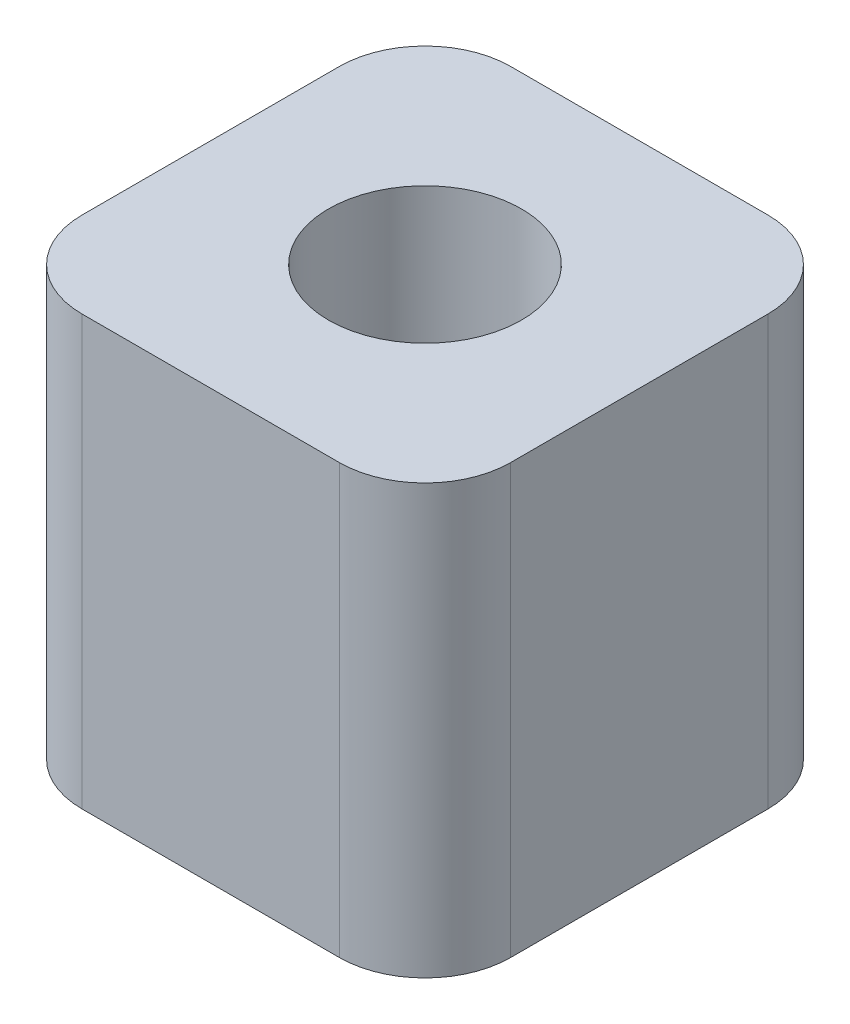
ISO-10303-21;
HEADER;
FILE_DESCRIPTION(('STEP AP214'),'2;1');
FILE_NAME('part.step','',(''),(''),'','','');
FILE_SCHEMA(('AUTOMOTIVE_DESIGN { 1 0 10303 214 1 1 1 1 }'));
ENDSEC;
DATA;
#1=APPLICATION_CONTEXT('core data for automotive mechanical design processes');
#2=APPLICATION_PROTOCOL_DEFINITION('international standard','automotive_design',2000,#1);
#3=PRODUCT_CONTEXT('',#1,'mechanical');
#4=PRODUCT('Part','Part','',(#3));
#5=PRODUCT_RELATED_PRODUCT_CATEGORY('part','',(#4));
#6=PRODUCT_DEFINITION_FORMATION('','',#4);
#7=PRODUCT_DEFINITION_CONTEXT('part definition',#1,'design');
#8=PRODUCT_DEFINITION('design','',#6,#7);
#9=PRODUCT_DEFINITION_SHAPE('','',#8);
#10=(LENGTH_UNIT() NAMED_UNIT(*) SI_UNIT(.MILLI.,.METRE.));
#11=(NAMED_UNIT(*) PLANE_ANGLE_UNIT() SI_UNIT($,.RADIAN.));
#12=(NAMED_UNIT(*) SI_UNIT($,.STERADIAN.) SOLID_ANGLE_UNIT());
#13=UNCERTAINTY_MEASURE_WITH_UNIT(LENGTH_MEASURE(1.E-05),#10,'distance_accuracy_value','');
#14=(GEOMETRIC_REPRESENTATION_CONTEXT(3) GLOBAL_UNCERTAINTY_ASSIGNED_CONTEXT((#13)) GLOBAL_UNIT_ASSIGNED_CONTEXT((#10,
#11,#12)) REPRESENTATION_CONTEXT('',''));
#15=CARTESIAN_POINT('',(0.,0.,0.));
#16=DIRECTION('',(0.,0.,1.));
#17=DIRECTION('',(1.,0.,0.));
#18=AXIS2_PLACEMENT_3D('',#15,#16,#17);
#19=CARTESIAN_POINT('',(0.,10.,0.));
#20=DIRECTION('',(0.,-1.,0.));
#21=DIRECTION('',(0.,0.,-1.));
#22=AXIS2_PLACEMENT_3D('',#19,#20,#21);
#23=PLANE('',#22);
#24=DIRECTION('',(0.,0.,1.));
#25=VECTOR('',#24,1.);
#26=CARTESIAN_POINT('',(-5.,10.,5.));
#27=LINE('',#26,#25);
#28=CARTESIAN_POINT('',(-5.,10.,-3.));
#29=VERTEX_POINT('',#28);
#30=CARTESIAN_POINT('',(-5.,10.,3.));
#31=VERTEX_POINT('',#30);
#32=EDGE_CURVE('E199',#29,#31,#27,.T.);
#33=ORIENTED_EDGE('',*,*,#32,.T.);
#34=CARTESIAN_POINT('',(-3.,10.,3.));
#35=DIRECTION('',(0.,-1.,0.));
#36=DIRECTION('',(0.,0.,-1.));
#37=AXIS2_PLACEMENT_3D('',#34,#35,#36);
#38=CIRCLE('',#37,2.);
#39=CARTESIAN_POINT('',(-3.,10.,5.));
#40=VERTEX_POINT('',#39);
#41=EDGE_CURVE('E168',#31,#40,#38,.F.);
#42=ORIENTED_EDGE('',*,*,#41,.T.);
#43=DIRECTION('',(1.,0.,0.));
#44=VECTOR('',#43,1.);
#45=CARTESIAN_POINT('',(-5.,10.,5.));
#46=LINE('',#45,#44);
#47=CARTESIAN_POINT('',(3.,10.,5.));
#48=VERTEX_POINT('',#47);
#49=EDGE_CURVE('E126',#40,#48,#46,.T.);
#50=ORIENTED_EDGE('',*,*,#49,.T.);
#51=CARTESIAN_POINT('',(3.,10.,3.));
#52=DIRECTION('',(0.,-1.,0.));
#53=DIRECTION('',(0.,0.,-1.));
#54=AXIS2_PLACEMENT_3D('',#51,#52,#53);
#55=CIRCLE('',#54,2.);
#56=CARTESIAN_POINT('',(5.,10.,3.));
#57=VERTEX_POINT('',#56);
#58=EDGE_CURVE('E160',#48,#57,#55,.F.);
#59=ORIENTED_EDGE('',*,*,#58,.T.);
#60=DIRECTION('',(0.,0.,-1.));
#61=VECTOR('',#60,1.);
#62=CARTESIAN_POINT('',(5.,10.,5.));
#63=LINE('',#62,#61);
#64=CARTESIAN_POINT('',(5.,10.,-3.));
#65=VERTEX_POINT('',#64);
#66=EDGE_CURVE('E135',#57,#65,#63,.T.);
#67=ORIENTED_EDGE('',*,*,#66,.T.);
#68=CARTESIAN_POINT('',(3.,10.,-3.));
#69=DIRECTION('',(0.,-1.,0.));
#70=DIRECTION('',(0.,0.,-1.));
#71=AXIS2_PLACEMENT_3D('',#68,#69,#70);
#72=CIRCLE('',#71,2.);
#73=CARTESIAN_POINT('',(3.,10.,-5.));
#74=VERTEX_POINT('',#73);
#75=EDGE_CURVE('E61',#65,#74,#72,.F.);
#76=ORIENTED_EDGE('',*,*,#75,.T.);
#77=DIRECTION('',(-1.,0.,0.));
#78=VECTOR('',#77,1.);
#79=CARTESIAN_POINT('',(-5.,10.,-5.));
#80=LINE('',#79,#78);
#81=CARTESIAN_POINT('',(-3.,10.,-5.));
#82=VERTEX_POINT('',#81);
#83=EDGE_CURVE('E140',#74,#82,#80,.T.);
#84=ORIENTED_EDGE('',*,*,#83,.T.);
#85=CARTESIAN_POINT('',(-3.,10.,-3.));
#86=DIRECTION('',(0.,-1.,0.));
#87=DIRECTION('',(0.,0.,-1.));
#88=AXIS2_PLACEMENT_3D('',#85,#86,#87);
#89=CIRCLE('',#88,2.);
#90=EDGE_CURVE('E165',#82,#29,#89,.F.);
#91=ORIENTED_EDGE('',*,*,#90,.T.);
#92=EDGE_LOOP('',(#33,#42,#50,#59,#67,#76,#84,#91));
#93=FACE_BOUND('',#92,.T.);
#94=CARTESIAN_POINT('',(0.,10.,0.));
#95=DIRECTION('',(0.,1.,0.));
#96=DIRECTION('',(0.,0.,1.));
#97=AXIS2_PLACEMENT_3D('',#94,#95,#96);
#98=CIRCLE('',#97,2.25);
#99=CARTESIAN_POINT('',(0.,10.,2.25));
#100=VERTEX_POINT('',#99);
#101=EDGE_CURVE('E189',#100,#100,#98,.T.);
#102=ORIENTED_EDGE('',*,*,#101,.F.);
#103=EDGE_LOOP('',(#102));
#104=FACE_BOUND('',#103,.T.);
#105=ADVANCED_FACE('F38',(#93,#104),#23,.F.);
#106=CARTESIAN_POINT('',(0.,0.,0.));
#107=DIRECTION('',(0.,-1.,0.));
#108=DIRECTION('',(0.,0.,-1.));
#109=AXIS2_PLACEMENT_3D('',#106,#107,#108);
#110=PLANE('',#109);
#111=DIRECTION('',(1.,0.,0.));
#112=VECTOR('',#111,1.);
#113=CARTESIAN_POINT('',(-5.,0.,5.));
#114=LINE('',#113,#112);
#115=CARTESIAN_POINT('',(-3.,0.,5.));
#116=VERTEX_POINT('',#115);
#117=CARTESIAN_POINT('',(3.,0.,5.));
#118=VERTEX_POINT('',#117);
#119=EDGE_CURVE('E123',#116,#118,#114,.T.);
#120=ORIENTED_EDGE('',*,*,#119,.F.);
#121=CARTESIAN_POINT('',(-3.,0.,3.));
#122=DIRECTION('',(0.,-1.,0.));
#123=DIRECTION('',(0.,0.,-1.));
#124=AXIS2_PLACEMENT_3D('',#121,#122,#123);
#125=CIRCLE('',#124,2.);
#126=CARTESIAN_POINT('',(-5.,0.,3.));
#127=VERTEX_POINT('',#126);
#128=EDGE_CURVE('E105',#116,#127,#125,.T.);
#129=ORIENTED_EDGE('',*,*,#128,.T.);
#130=DIRECTION('',(0.,0.,1.));
#131=VECTOR('',#130,1.);
#132=CARTESIAN_POINT('',(-5.,0.,5.));
#133=LINE('',#132,#131);
#134=CARTESIAN_POINT('',(-5.,0.,-3.));
#135=VERTEX_POINT('',#134);
#136=EDGE_CURVE('E136',#135,#127,#133,.T.);
#137=ORIENTED_EDGE('',*,*,#136,.F.);
#138=CARTESIAN_POINT('',(-3.,0.,-3.));
#139=DIRECTION('',(0.,-1.,0.));
#140=DIRECTION('',(0.,0.,-1.));
#141=AXIS2_PLACEMENT_3D('',#138,#139,#140);
#142=CIRCLE('',#141,2.);
#143=CARTESIAN_POINT('',(-3.,0.,-5.));
#144=VERTEX_POINT('',#143);
#145=EDGE_CURVE('E117',#135,#144,#142,.T.);
#146=ORIENTED_EDGE('',*,*,#145,.T.);
#147=DIRECTION('',(-1.,0.,0.));
#148=VECTOR('',#147,1.);
#149=CARTESIAN_POINT('',(-5.,0.,-5.));
#150=LINE('',#149,#148);
#151=CARTESIAN_POINT('',(3.,0.,-5.));
#152=VERTEX_POINT('',#151);
#153=EDGE_CURVE('E142',#152,#144,#150,.T.);
#154=ORIENTED_EDGE('',*,*,#153,.F.);
#155=CARTESIAN_POINT('',(3.,0.,-3.));
#156=DIRECTION('',(0.,-1.,0.));
#157=DIRECTION('',(0.,0.,-1.));
#158=AXIS2_PLACEMENT_3D('',#155,#156,#157);
#159=CIRCLE('',#158,2.);
#160=CARTESIAN_POINT('',(5.,0.,-3.));
#161=VERTEX_POINT('',#160);
#162=EDGE_CURVE('E150',#152,#161,#159,.T.);
#163=ORIENTED_EDGE('',*,*,#162,.T.);
#164=DIRECTION('',(0.,0.,-1.));
#165=VECTOR('',#164,1.);
#166=CARTESIAN_POINT('',(5.,0.,5.));
#167=LINE('',#166,#165);
#168=CARTESIAN_POINT('',(5.,0.,3.));
#169=VERTEX_POINT('',#168);
#170=EDGE_CURVE('E183',#169,#161,#167,.T.);
#171=ORIENTED_EDGE('',*,*,#170,.F.);
#172=CARTESIAN_POINT('',(3.,0.,3.));
#173=DIRECTION('',(0.,-1.,0.));
#174=DIRECTION('',(0.,0.,-1.));
#175=AXIS2_PLACEMENT_3D('',#172,#173,#174);
#176=CIRCLE('',#175,2.);
#177=EDGE_CURVE('E128',#169,#118,#176,.T.);
#178=ORIENTED_EDGE('',*,*,#177,.T.);
#179=EDGE_LOOP('',(#120,#129,#137,#146,#154,#163,#171,#178));
#180=FACE_BOUND('',#179,.T.);
#181=CARTESIAN_POINT('',(0.,0.,0.));
#182=DIRECTION('',(0.,1.,0.));
#183=DIRECTION('',(0.,0.,1.));
#184=AXIS2_PLACEMENT_3D('',#181,#182,#183);
#185=CIRCLE('',#184,2.25);
#186=CARTESIAN_POINT('',(0.,0.,2.25));
#187=VERTEX_POINT('',#186);
#188=EDGE_CURVE('E194',#187,#187,#185,.T.);
#189=ORIENTED_EDGE('',*,*,#188,.T.);
#190=EDGE_LOOP('',(#189));
#191=FACE_BOUND('',#190,.T.);
#192=ADVANCED_FACE('F131',(#180,#191),#110,.T.);
#193=CARTESIAN_POINT('',(5.,10.,5.));
#194=DIRECTION('',(-1.,0.,0.));
#195=DIRECTION('',(0.,0.,1.));
#196=AXIS2_PLACEMENT_3D('',#193,#194,#195);
#197=PLANE('',#196);
#198=ORIENTED_EDGE('',*,*,#170,.T.);
#199=DIRECTION('',(0.,-1.,0.));
#200=VECTOR('',#199,1.);
#201=CARTESIAN_POINT('',(5.,10.,-3.));
#202=LINE('',#201,#200);
#203=EDGE_CURVE('E11',#161,#65,#202,.F.);
#204=ORIENTED_EDGE('',*,*,#203,.T.);
#205=ORIENTED_EDGE('',*,*,#66,.F.);
#206=DIRECTION('',(0.,-1.,0.));
#207=VECTOR('',#206,1.);
#208=CARTESIAN_POINT('',(5.,10.,3.));
#209=LINE('',#208,#207);
#210=EDGE_CURVE('E47',#57,#169,#209,.T.);
#211=ORIENTED_EDGE('',*,*,#210,.T.);
#212=EDGE_LOOP('',(#198,#204,#205,#211));
#213=FACE_BOUND('',#212,.T.);
#214=ADVANCED_FACE('F182',(#213),#197,.F.);
#215=CARTESIAN_POINT('',(-5.,10.,-5.));
#216=DIRECTION('',(0.,0.,1.));
#217=DIRECTION('',(1.,0.,0.));
#218=AXIS2_PLACEMENT_3D('',#215,#216,#217);
#219=PLANE('',#218);
#220=ORIENTED_EDGE('',*,*,#153,.T.);
#221=DIRECTION('',(0.,-1.,0.));
#222=VECTOR('',#221,1.);
#223=CARTESIAN_POINT('',(-3.,10.,-5.));
#224=LINE('',#223,#222);
#225=EDGE_CURVE('E54',#144,#82,#224,.F.);
#226=ORIENTED_EDGE('',*,*,#225,.T.);
#227=ORIENTED_EDGE('',*,*,#83,.F.);
#228=DIRECTION('',(0.,-1.,0.));
#229=VECTOR('',#228,1.);
#230=CARTESIAN_POINT('',(3.,10.,-5.));
#231=LINE('',#230,#229);
#232=EDGE_CURVE('E171',#74,#152,#231,.T.);
#233=ORIENTED_EDGE('',*,*,#232,.T.);
#234=EDGE_LOOP('',(#220,#226,#227,#233));
#235=FACE_BOUND('',#234,.T.);
#236=ADVANCED_FACE('F231',(#235),#219,.F.);
#237=CARTESIAN_POINT('',(-5.,10.,5.));
#238=DIRECTION('',(1.,0.,0.));
#239=DIRECTION('',(0.,0.,-1.));
#240=AXIS2_PLACEMENT_3D('',#237,#238,#239);
#241=PLANE('',#240);
#242=ORIENTED_EDGE('',*,*,#136,.T.);
#243=DIRECTION('',(0.,-1.,0.));
#244=VECTOR('',#243,1.);
#245=CARTESIAN_POINT('',(-5.,10.,3.));
#246=LINE('',#245,#244);
#247=EDGE_CURVE('E110',#127,#31,#246,.F.);
#248=ORIENTED_EDGE('',*,*,#247,.T.);
#249=ORIENTED_EDGE('',*,*,#32,.F.);
#250=DIRECTION('',(0.,-1.,0.));
#251=VECTOR('',#250,1.);
#252=CARTESIAN_POINT('',(-5.,10.,-3.));
#253=LINE('',#252,#251);
#254=EDGE_CURVE('E116',#29,#135,#253,.T.);
#255=ORIENTED_EDGE('',*,*,#254,.T.);
#256=EDGE_LOOP('',(#242,#248,#249,#255));
#257=FACE_BOUND('',#256,.T.);
#258=ADVANCED_FACE('F219',(#257),#241,.F.);
#259=CARTESIAN_POINT('',(-5.,10.,5.));
#260=DIRECTION('',(0.,0.,-1.));
#261=DIRECTION('',(-1.,0.,0.));
#262=AXIS2_PLACEMENT_3D('',#259,#260,#261);
#263=PLANE('',#262);
#264=ORIENTED_EDGE('',*,*,#49,.F.);
#265=DIRECTION('',(0.,-1.,0.));
#266=VECTOR('',#265,1.);
#267=CARTESIAN_POINT('',(-3.,10.,5.));
#268=LINE('',#267,#266);
#269=EDGE_CURVE('E109',#40,#116,#268,.T.);
#270=ORIENTED_EDGE('',*,*,#269,.T.);
#271=ORIENTED_EDGE('',*,*,#119,.T.);
#272=DIRECTION('',(0.,-1.,0.));
#273=VECTOR('',#272,1.);
#274=CARTESIAN_POINT('',(3.,10.,5.));
#275=LINE('',#274,#273);
#276=EDGE_CURVE('E129',#118,#48,#275,.F.);
#277=ORIENTED_EDGE('',*,*,#276,.T.);
#278=EDGE_LOOP('',(#264,#270,#271,#277));
#279=FACE_BOUND('',#278,.T.);
#280=ADVANCED_FACE('F122',(#279),#263,.F.);
#281=CARTESIAN_POINT('',(0.,10.,0.));
#282=DIRECTION('',(0.,-1.,0.));
#283=DIRECTION('',(0.,0.,-1.));
#284=AXIS2_PLACEMENT_3D('',#281,#282,#283);
#285=CYLINDRICAL_SURFACE('',#284,2.25);
#286=ORIENTED_EDGE('',*,*,#101,.T.);
#287=EDGE_LOOP('',(#286));
#288=FACE_BOUND('',#287,.T.);
#289=ORIENTED_EDGE('',*,*,#188,.F.);
#290=EDGE_LOOP('',(#289));
#291=FACE_BOUND('',#290,.T.);
#292=ADVANCED_FACE('F209',(#288,#291),#285,.F.);
#293=CARTESIAN_POINT('',(-3.,10.,3.));
#294=DIRECTION('',(0.,-1.,0.));
#295=DIRECTION('',(0.,0.,-1.));
#296=AXIS2_PLACEMENT_3D('',#293,#294,#295);
#297=CYLINDRICAL_SURFACE('',#296,2.);
#298=ORIENTED_EDGE('',*,*,#41,.F.);
#299=ORIENTED_EDGE('',*,*,#247,.F.);
#300=ORIENTED_EDGE('',*,*,#128,.F.);
#301=ORIENTED_EDGE('',*,*,#269,.F.);
#302=EDGE_LOOP('',(#298,#299,#300,#301));
#303=FACE_BOUND('',#302,.T.);
#304=ADVANCED_FACE('F108',(#303),#297,.T.);
#305=CARTESIAN_POINT('',(-3.,10.,-3.));
#306=DIRECTION('',(0.,-1.,0.));
#307=DIRECTION('',(0.,0.,-1.));
#308=AXIS2_PLACEMENT_3D('',#305,#306,#307);
#309=CYLINDRICAL_SURFACE('',#308,2.);
#310=ORIENTED_EDGE('',*,*,#90,.F.);
#311=ORIENTED_EDGE('',*,*,#225,.F.);
#312=ORIENTED_EDGE('',*,*,#145,.F.);
#313=ORIENTED_EDGE('',*,*,#254,.F.);
#314=EDGE_LOOP('',(#310,#311,#312,#313));
#315=FACE_BOUND('',#314,.T.);
#316=ADVANCED_FACE('F217',(#315),#309,.T.);
#317=CARTESIAN_POINT('',(3.,10.,-3.));
#318=DIRECTION('',(0.,-1.,0.));
#319=DIRECTION('',(0.,0.,-1.));
#320=AXIS2_PLACEMENT_3D('',#317,#318,#319);
#321=CYLINDRICAL_SURFACE('',#320,2.);
#322=ORIENTED_EDGE('',*,*,#75,.F.);
#323=ORIENTED_EDGE('',*,*,#203,.F.);
#324=ORIENTED_EDGE('',*,*,#162,.F.);
#325=ORIENTED_EDGE('',*,*,#232,.F.);
#326=EDGE_LOOP('',(#322,#323,#324,#325));
#327=FACE_BOUND('',#326,.T.);
#328=ADVANCED_FACE('F238',(#327),#321,.T.);
#329=CARTESIAN_POINT('',(3.,10.,3.));
#330=DIRECTION('',(0.,-1.,0.));
#331=DIRECTION('',(0.,0.,-1.));
#332=AXIS2_PLACEMENT_3D('',#329,#330,#331);
#333=CYLINDRICAL_SURFACE('',#332,2.);
#334=ORIENTED_EDGE('',*,*,#58,.F.);
#335=ORIENTED_EDGE('',*,*,#276,.F.);
#336=ORIENTED_EDGE('',*,*,#177,.F.);
#337=ORIENTED_EDGE('',*,*,#210,.F.);
#338=EDGE_LOOP('',(#334,#335,#336,#337));
#339=FACE_BOUND('',#338,.T.);
#340=ADVANCED_FACE('F40',(#339),#333,.T.);
#341=CLOSED_SHELL('',(#105,#192,#214,#236,#258,#280,#292,#304,#316,#328,#340));
#342=MANIFOLD_SOLID_BREP('B2',#341);
#343=ADVANCED_BREP_SHAPE_REPRESENTATION('',(#18,#342),#14);
#344=SHAPE_DEFINITION_REPRESENTATION(#9,#343);
ENDSEC;
END-ISO-10303-21;
